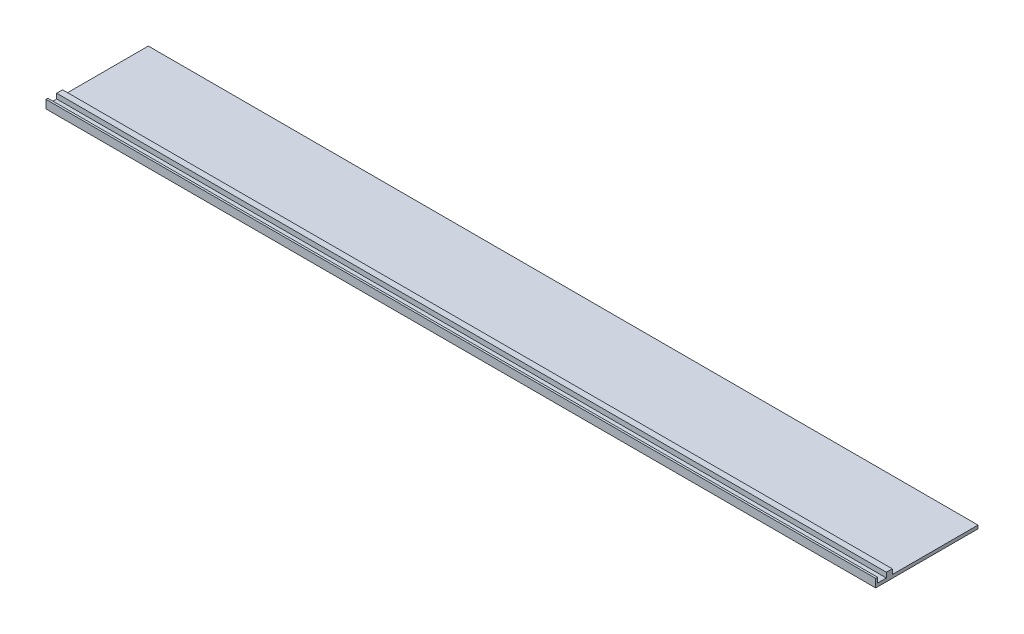
ISO-10303-21;
HEADER;
FILE_DESCRIPTION(('STEP AP214'),'2;1');
FILE_NAME('part.step','',(''),(''),'','','');
FILE_SCHEMA(('AUTOMOTIVE_DESIGN { 1 0 10303 214 1 1 1 1 }'));
ENDSEC;
DATA;
#1=APPLICATION_CONTEXT('core data for automotive mechanical design processes');
#2=APPLICATION_PROTOCOL_DEFINITION('international standard','automotive_design',2000,#1);
#3=PRODUCT_CONTEXT('',#1,'mechanical');
#4=PRODUCT('Part','Part','',(#3));
#5=PRODUCT_RELATED_PRODUCT_CATEGORY('part','',(#4));
#6=PRODUCT_DEFINITION_FORMATION('','',#4);
#7=PRODUCT_DEFINITION_CONTEXT('part definition',#1,'design');
#8=PRODUCT_DEFINITION('design','',#6,#7);
#9=PRODUCT_DEFINITION_SHAPE('','',#8);
#10=(LENGTH_UNIT() NAMED_UNIT(*) SI_UNIT(.MILLI.,.METRE.));
#11=(NAMED_UNIT(*) PLANE_ANGLE_UNIT() SI_UNIT($,.RADIAN.));
#12=(NAMED_UNIT(*) SI_UNIT($,.STERADIAN.) SOLID_ANGLE_UNIT());
#13=UNCERTAINTY_MEASURE_WITH_UNIT(LENGTH_MEASURE(1.E-05),#10,'distance_accuracy_value','');
#14=(GEOMETRIC_REPRESENTATION_CONTEXT(3) GLOBAL_UNCERTAINTY_ASSIGNED_CONTEXT((#13)) GLOBAL_UNIT_ASSIGNED_CONTEXT((#10,
#11,#12)) REPRESENTATION_CONTEXT('',''));
#15=CARTESIAN_POINT('',(0.,0.,0.));
#16=DIRECTION('',(0.,0.,1.));
#17=DIRECTION('',(1.,0.,0.));
#18=AXIS2_PLACEMENT_3D('',#15,#16,#17);
#19=CARTESIAN_POINT('',(1500.,0.,92.5));
#20=DIRECTION('',(0.,0.,-1.));
#21=DIRECTION('',(-1.,0.,0.));
#22=AXIS2_PLACEMENT_3D('',#19,#20,#21);
#23=PLANE('',#22);
#24=DIRECTION('',(0.,-1.,0.));
#25=VECTOR('',#24,1.);
#26=CARTESIAN_POINT('',(0.,0.,92.5));
#27=LINE('',#26,#25);
#28=CARTESIAN_POINT('',(0.,15.,92.5));
#29=VERTEX_POINT('',#28);
#30=CARTESIAN_POINT('',(0.,0.,92.5));
#31=VERTEX_POINT('',#30);
#32=EDGE_CURVE('E145',#29,#31,#27,.T.);
#33=ORIENTED_EDGE('',*,*,#32,.T.);
#34=DIRECTION('',(-1.,0.,0.));
#35=VECTOR('',#34,1.);
#36=CARTESIAN_POINT('',(1500.,0.,92.5));
#37=LINE('',#36,#35);
#38=CARTESIAN_POINT('',(1500.,0.,92.5));
#39=VERTEX_POINT('',#38);
#40=EDGE_CURVE('E11',#39,#31,#37,.T.);
#41=ORIENTED_EDGE('',*,*,#40,.F.);
#42=DIRECTION('',(0.,-1.,0.));
#43=VECTOR('',#42,1.);
#44=CARTESIAN_POINT('',(1500.,0.,92.5));
#45=LINE('',#44,#43);
#46=CARTESIAN_POINT('',(1500.,15.,92.5));
#47=VERTEX_POINT('',#46);
#48=EDGE_CURVE('E163',#47,#39,#45,.T.);
#49=ORIENTED_EDGE('',*,*,#48,.F.);
#50=DIRECTION('',(-1.,0.,0.));
#51=VECTOR('',#50,1.);
#52=CARTESIAN_POINT('',(1500.,15.,92.5));
#53=LINE('',#52,#51);
#54=EDGE_CURVE('E141',#47,#29,#53,.T.);
#55=ORIENTED_EDGE('',*,*,#54,.T.);
#56=EDGE_LOOP('',(#33,#41,#49,#55));
#57=FACE_BOUND('',#56,.T.);
#58=ADVANCED_FACE('F37',(#57),#23,.F.);
#59=CARTESIAN_POINT('',(1500.,0.,92.5));
#60=DIRECTION('',(0.,1.,0.));
#61=DIRECTION('',(0.,0.,1.));
#62=AXIS2_PLACEMENT_3D('',#59,#60,#61);
#63=PLANE('',#62);
#64=DIRECTION('',(0.,0.,-1.));
#65=VECTOR('',#64,1.);
#66=CARTESIAN_POINT('',(0.,0.,92.5));
#67=LINE('',#66,#65);
#68=CARTESIAN_POINT('',(0.,0.,-92.5));
#69=VERTEX_POINT('',#68);
#70=EDGE_CURVE('E148',#31,#69,#67,.T.);
#71=ORIENTED_EDGE('',*,*,#70,.T.);
#72=DIRECTION('',(-1.,0.,0.));
#73=VECTOR('',#72,1.);
#74=CARTESIAN_POINT('',(1500.,0.,-92.5));
#75=LINE('',#74,#73);
#76=CARTESIAN_POINT('',(1500.,0.,-92.5));
#77=VERTEX_POINT('',#76);
#78=EDGE_CURVE('E45',#77,#69,#75,.T.);
#79=ORIENTED_EDGE('',*,*,#78,.F.);
#80=DIRECTION('',(0.,0.,-1.));
#81=VECTOR('',#80,1.);
#82=CARTESIAN_POINT('',(1500.,0.,92.5));
#83=LINE('',#82,#81);
#84=EDGE_CURVE('E102',#39,#77,#83,.T.);
#85=ORIENTED_EDGE('',*,*,#84,.F.);
#86=ORIENTED_EDGE('',*,*,#40,.T.);
#87=EDGE_LOOP('',(#71,#79,#85,#86));
#88=FACE_BOUND('',#87,.T.);
#89=ADVANCED_FACE('F212',(#88),#63,.F.);
#90=CARTESIAN_POINT('',(1500.,6.,-92.5));
#91=DIRECTION('',(0.,0.,1.));
#92=DIRECTION('',(1.,0.,0.));
#93=AXIS2_PLACEMENT_3D('',#90,#91,#92);
#94=PLANE('',#93);
#95=DIRECTION('',(0.,1.,0.));
#96=VECTOR('',#95,1.);
#97=CARTESIAN_POINT('',(0.,6.,-92.5));
#98=LINE('',#97,#96);
#99=CARTESIAN_POINT('',(0.,6.,-92.5));
#100=VERTEX_POINT('',#99);
#101=EDGE_CURVE('E150',#69,#100,#98,.T.);
#102=ORIENTED_EDGE('',*,*,#101,.T.);
#103=DIRECTION('',(-1.,0.,0.));
#104=VECTOR('',#103,1.);
#105=CARTESIAN_POINT('',(1500.,6.,-92.5));
#106=LINE('',#105,#104);
#107=CARTESIAN_POINT('',(1500.,6.,-92.5));
#108=VERTEX_POINT('',#107);
#109=EDGE_CURVE('E176',#108,#100,#106,.T.);
#110=ORIENTED_EDGE('',*,*,#109,.F.);
#111=DIRECTION('',(0.,1.,0.));
#112=VECTOR('',#111,1.);
#113=CARTESIAN_POINT('',(1500.,6.,-92.5));
#114=LINE('',#113,#112);
#115=EDGE_CURVE('E184',#77,#108,#114,.T.);
#116=ORIENTED_EDGE('',*,*,#115,.F.);
#117=ORIENTED_EDGE('',*,*,#78,.T.);
#118=EDGE_LOOP('',(#102,#110,#116,#117));
#119=FACE_BOUND('',#118,.T.);
#120=ADVANCED_FACE('F182',(#119),#94,.F.);
#121=CARTESIAN_POINT('',(1500.,6.,62.5156718863435));
#122=DIRECTION('',(0.,-1.,0.));
#123=DIRECTION('',(0.,0.,-1.));
#124=AXIS2_PLACEMENT_3D('',#121,#122,#123);
#125=PLANE('',#124);
#126=DIRECTION('',(0.,0.,1.));
#127=VECTOR('',#126,1.);
#128=CARTESIAN_POINT('',(0.,6.,62.5156718863435));
#129=LINE('',#128,#127);
#130=CARTESIAN_POINT('',(0.,6.,62.5156718863435));
#131=VERTEX_POINT('',#130);
#132=EDGE_CURVE('E152',#100,#131,#129,.T.);
#133=ORIENTED_EDGE('',*,*,#132,.T.);
#134=DIRECTION('',(-1.,0.,0.));
#135=VECTOR('',#134,1.);
#136=CARTESIAN_POINT('',(1500.,6.,62.5156718863435));
#137=LINE('',#136,#135);
#138=CARTESIAN_POINT('',(1500.,6.,62.5156718863435));
#139=VERTEX_POINT('',#138);
#140=EDGE_CURVE('E173',#139,#131,#137,.T.);
#141=ORIENTED_EDGE('',*,*,#140,.F.);
#142=DIRECTION('',(0.,0.,1.));
#143=VECTOR('',#142,1.);
#144=CARTESIAN_POINT('',(1500.,6.,62.5156718863435));
#145=LINE('',#144,#143);
#146=EDGE_CURVE('E202',#108,#139,#145,.T.);
#147=ORIENTED_EDGE('',*,*,#146,.F.);
#148=ORIENTED_EDGE('',*,*,#109,.T.);
#149=EDGE_LOOP('',(#133,#141,#147,#148));
#150=FACE_BOUND('',#149,.T.);
#151=ADVANCED_FACE('F193',(#150),#125,.F.);
#152=CARTESIAN_POINT('',(1500.,15.,62.5156718863435));
#153=DIRECTION('',(0.,0.,1.));
#154=DIRECTION('',(1.,0.,0.));
#155=AXIS2_PLACEMENT_3D('',#152,#153,#154);
#156=PLANE('',#155);
#157=DIRECTION('',(0.,1.,0.));
#158=VECTOR('',#157,1.);
#159=CARTESIAN_POINT('',(0.,15.,62.5156718863435));
#160=LINE('',#159,#158);
#161=CARTESIAN_POINT('',(0.,15.,62.5156718863435));
#162=VERTEX_POINT('',#161);
#163=EDGE_CURVE('E154',#131,#162,#160,.T.);
#164=ORIENTED_EDGE('',*,*,#163,.T.);
#165=DIRECTION('',(-1.,0.,0.));
#166=VECTOR('',#165,1.);
#167=CARTESIAN_POINT('',(1500.,15.,62.5156718863435));
#168=LINE('',#167,#166);
#169=CARTESIAN_POINT('',(1500.,15.,62.5156718863435));
#170=VERTEX_POINT('',#169);
#171=EDGE_CURVE('E170',#170,#162,#168,.T.);
#172=ORIENTED_EDGE('',*,*,#171,.F.);
#173=DIRECTION('',(0.,1.,0.));
#174=VECTOR('',#173,1.);
#175=CARTESIAN_POINT('',(1500.,15.,62.5156718863435));
#176=LINE('',#175,#174);
#177=EDGE_CURVE('E199',#139,#170,#176,.T.);
#178=ORIENTED_EDGE('',*,*,#177,.F.);
#179=ORIENTED_EDGE('',*,*,#140,.T.);
#180=EDGE_LOOP('',(#164,#172,#178,#179));
#181=FACE_BOUND('',#180,.T.);
#182=ADVANCED_FACE('F197',(#181),#156,.F.);
#183=CARTESIAN_POINT('',(1500.,15.,73.2479760728402));
#184=DIRECTION('',(0.,-1.,0.));
#185=DIRECTION('',(0.,0.,-1.));
#186=AXIS2_PLACEMENT_3D('',#183,#184,#185);
#187=PLANE('',#186);
#188=DIRECTION('',(0.,0.,1.));
#189=VECTOR('',#188,1.);
#190=CARTESIAN_POINT('',(0.,15.,73.2479760728402));
#191=LINE('',#190,#189);
#192=CARTESIAN_POINT('',(0.,15.,73.2479760728402));
#193=VERTEX_POINT('',#192);
#194=EDGE_CURVE('E156',#162,#193,#191,.T.);
#195=ORIENTED_EDGE('',*,*,#194,.T.);
#196=DIRECTION('',(-1.,0.,0.));
#197=VECTOR('',#196,1.);
#198=CARTESIAN_POINT('',(1500.,15.,73.2479760728402));
#199=LINE('',#198,#197);
#200=CARTESIAN_POINT('',(1500.,15.,73.2479760728402));
#201=VERTEX_POINT('',#200);
#202=EDGE_CURVE('E167',#201,#193,#199,.T.);
#203=ORIENTED_EDGE('',*,*,#202,.F.);
#204=DIRECTION('',(0.,0.,1.));
#205=VECTOR('',#204,1.);
#206=CARTESIAN_POINT('',(1500.,15.,73.2479760728402));
#207=LINE('',#206,#205);
#208=EDGE_CURVE('E201',#170,#201,#207,.T.);
#209=ORIENTED_EDGE('',*,*,#208,.F.);
#210=ORIENTED_EDGE('',*,*,#171,.T.);
#211=EDGE_LOOP('',(#195,#203,#209,#210));
#212=FACE_BOUND('',#211,.T.);
#213=ADVANCED_FACE('F224',(#212),#187,.F.);
#214=CARTESIAN_POINT('',(1500.,6.,73.2479760728402));
#215=DIRECTION('',(0.,0.,-1.));
#216=DIRECTION('',(-1.,0.,0.));
#217=AXIS2_PLACEMENT_3D('',#214,#215,#216);
#218=PLANE('',#217);
#219=DIRECTION('',(0.,-1.,0.));
#220=VECTOR('',#219,1.);
#221=CARTESIAN_POINT('',(0.,6.,73.2479760728402));
#222=LINE('',#221,#220);
#223=CARTESIAN_POINT('',(0.,6.,73.2479760728402));
#224=VERTEX_POINT('',#223);
#225=EDGE_CURVE('E158',#193,#224,#222,.T.);
#226=ORIENTED_EDGE('',*,*,#225,.T.);
#227=DIRECTION('',(-1.,0.,0.));
#228=VECTOR('',#227,1.);
#229=CARTESIAN_POINT('',(1500.,6.,73.2479760728402));
#230=LINE('',#229,#228);
#231=CARTESIAN_POINT('',(1500.,6.,73.2479760728402));
#232=VERTEX_POINT('',#231);
#233=EDGE_CURVE('E136',#232,#224,#230,.T.);
#234=ORIENTED_EDGE('',*,*,#233,.F.);
#235=DIRECTION('',(0.,-1.,0.));
#236=VECTOR('',#235,1.);
#237=CARTESIAN_POINT('',(1500.,6.,73.2479760728402));
#238=LINE('',#237,#236);
#239=EDGE_CURVE('E127',#201,#232,#238,.T.);
#240=ORIENTED_EDGE('',*,*,#239,.F.);
#241=ORIENTED_EDGE('',*,*,#202,.T.);
#242=EDGE_LOOP('',(#226,#234,#240,#241));
#243=FACE_BOUND('',#242,.T.);
#244=ADVANCED_FACE('F227',(#243),#218,.F.);
#245=CARTESIAN_POINT('',(1500.,6.,88.9886888797021));
#246=DIRECTION('',(0.,-1.,0.));
#247=DIRECTION('',(0.,0.,-1.));
#248=AXIS2_PLACEMENT_3D('',#245,#246,#247);
#249=PLANE('',#248);
#250=DIRECTION('',(0.,0.,1.));
#251=VECTOR('',#250,1.);
#252=CARTESIAN_POINT('',(0.,6.,88.9886888797021));
#253=LINE('',#252,#251);
#254=CARTESIAN_POINT('',(0.,6.,88.9886888797021));
#255=VERTEX_POINT('',#254);
#256=EDGE_CURVE('E135',#224,#255,#253,.T.);
#257=ORIENTED_EDGE('',*,*,#256,.T.);
#258=DIRECTION('',(-1.,0.,0.));
#259=VECTOR('',#258,1.);
#260=CARTESIAN_POINT('',(1500.,6.,88.9886888797021));
#261=LINE('',#260,#259);
#262=CARTESIAN_POINT('',(1500.,6.,88.9886888797021));
#263=VERTEX_POINT('',#262);
#264=EDGE_CURVE('E132',#263,#255,#261,.T.);
#265=ORIENTED_EDGE('',*,*,#264,.F.);
#266=DIRECTION('',(0.,0.,1.));
#267=VECTOR('',#266,1.);
#268=CARTESIAN_POINT('',(1500.,6.,88.9886888797021));
#269=LINE('',#268,#267);
#270=EDGE_CURVE('E121',#232,#263,#269,.T.);
#271=ORIENTED_EDGE('',*,*,#270,.F.);
#272=ORIENTED_EDGE('',*,*,#233,.T.);
#273=EDGE_LOOP('',(#257,#265,#271,#272));
#274=FACE_BOUND('',#273,.T.);
#275=ADVANCED_FACE('F133',(#274),#249,.F.);
#276=CARTESIAN_POINT('',(1500.,15.,88.9886888797021));
#277=DIRECTION('',(0.,0.,1.));
#278=DIRECTION('',(1.,0.,0.));
#279=AXIS2_PLACEMENT_3D('',#276,#277,#278);
#280=PLANE('',#279);
#281=DIRECTION('',(0.,1.,0.));
#282=VECTOR('',#281,1.);
#283=CARTESIAN_POINT('',(0.,15.,88.9886888797021));
#284=LINE('',#283,#282);
#285=CARTESIAN_POINT('',(0.,15.,88.9886888797021));
#286=VERTEX_POINT('',#285);
#287=EDGE_CURVE('E88',#255,#286,#284,.T.);
#288=ORIENTED_EDGE('',*,*,#287,.T.);
#289=DIRECTION('',(-1.,0.,0.));
#290=VECTOR('',#289,1.);
#291=CARTESIAN_POINT('',(1500.,15.,88.9886888797021));
#292=LINE('',#291,#290);
#293=CARTESIAN_POINT('',(1500.,15.,88.9886888797021));
#294=VERTEX_POINT('',#293);
#295=EDGE_CURVE('E137',#294,#286,#292,.T.);
#296=ORIENTED_EDGE('',*,*,#295,.F.);
#297=DIRECTION('',(0.,1.,0.));
#298=VECTOR('',#297,1.);
#299=CARTESIAN_POINT('',(1500.,15.,88.9886888797021));
#300=LINE('',#299,#298);
#301=EDGE_CURVE('E125',#263,#294,#300,.T.);
#302=ORIENTED_EDGE('',*,*,#301,.F.);
#303=ORIENTED_EDGE('',*,*,#264,.T.);
#304=EDGE_LOOP('',(#288,#296,#302,#303));
#305=FACE_BOUND('',#304,.T.);
#306=ADVANCED_FACE('F139',(#305),#280,.F.);
#307=CARTESIAN_POINT('',(1500.,15.,92.5));
#308=DIRECTION('',(0.,-1.,0.));
#309=DIRECTION('',(0.,0.,-1.));
#310=AXIS2_PLACEMENT_3D('',#307,#308,#309);
#311=PLANE('',#310);
#312=DIRECTION('',(0.,0.,1.));
#313=VECTOR('',#312,1.);
#314=CARTESIAN_POINT('',(0.,15.,92.5));
#315=LINE('',#314,#313);
#316=EDGE_CURVE('E94',#286,#29,#315,.T.);
#317=ORIENTED_EDGE('',*,*,#316,.T.);
#318=ORIENTED_EDGE('',*,*,#54,.F.);
#319=DIRECTION('',(0.,0.,1.));
#320=VECTOR('',#319,1.);
#321=CARTESIAN_POINT('',(1500.,15.,92.5));
#322=LINE('',#321,#320);
#323=EDGE_CURVE('E53',#294,#47,#322,.T.);
#324=ORIENTED_EDGE('',*,*,#323,.F.);
#325=ORIENTED_EDGE('',*,*,#295,.T.);
#326=EDGE_LOOP('',(#317,#318,#324,#325));
#327=FACE_BOUND('',#326,.T.);
#328=ADVANCED_FACE('F236',(#327),#311,.F.);
#329=CARTESIAN_POINT('',(1500.,0.,0.));
#330=DIRECTION('',(-1.,0.,0.));
#331=DIRECTION('',(0.,0.,1.));
#332=AXIS2_PLACEMENT_3D('',#329,#330,#331);
#333=PLANE('',#332);
#334=ORIENTED_EDGE('',*,*,#48,.T.);
#335=ORIENTED_EDGE('',*,*,#84,.T.);
#336=ORIENTED_EDGE('',*,*,#115,.T.);
#337=ORIENTED_EDGE('',*,*,#146,.T.);
#338=ORIENTED_EDGE('',*,*,#177,.T.);
#339=ORIENTED_EDGE('',*,*,#208,.T.);
#340=ORIENTED_EDGE('',*,*,#239,.T.);
#341=ORIENTED_EDGE('',*,*,#270,.T.);
#342=ORIENTED_EDGE('',*,*,#301,.T.);
#343=ORIENTED_EDGE('',*,*,#323,.T.);
#344=EDGE_LOOP('',(#334,#335,#336,#337,#338,#339,#340,#341,#342,#343));
#345=FACE_BOUND('',#344,.T.);
#346=ADVANCED_FACE('F123',(#345),#333,.F.);
#347=CARTESIAN_POINT('',(0.,0.,0.));
#348=DIRECTION('',(-1.,0.,0.));
#349=DIRECTION('',(0.,0.,1.));
#350=AXIS2_PLACEMENT_3D('',#347,#348,#349);
#351=PLANE('',#350);
#352=ORIENTED_EDGE('',*,*,#32,.F.);
#353=ORIENTED_EDGE('',*,*,#316,.F.);
#354=ORIENTED_EDGE('',*,*,#287,.F.);
#355=ORIENTED_EDGE('',*,*,#256,.F.);
#356=ORIENTED_EDGE('',*,*,#225,.F.);
#357=ORIENTED_EDGE('',*,*,#194,.F.);
#358=ORIENTED_EDGE('',*,*,#163,.F.);
#359=ORIENTED_EDGE('',*,*,#132,.F.);
#360=ORIENTED_EDGE('',*,*,#101,.F.);
#361=ORIENTED_EDGE('',*,*,#70,.F.);
#362=EDGE_LOOP('',(#352,#353,#354,#355,#356,#357,#358,#359,#360,#361));
#363=FACE_BOUND('',#362,.T.);
#364=ADVANCED_FACE('F188',(#363),#351,.T.);
#365=CLOSED_SHELL('',(#58,#89,#120,#151,#182,#213,#244,#275,#306,#328,#346,#364));
#366=MANIFOLD_SOLID_BREP('B2',#365);
#367=ADVANCED_BREP_SHAPE_REPRESENTATION('',(#18,#366),#14);
#368=SHAPE_DEFINITION_REPRESENTATION(#9,#367);
ENDSEC;
END-ISO-10303-21;
